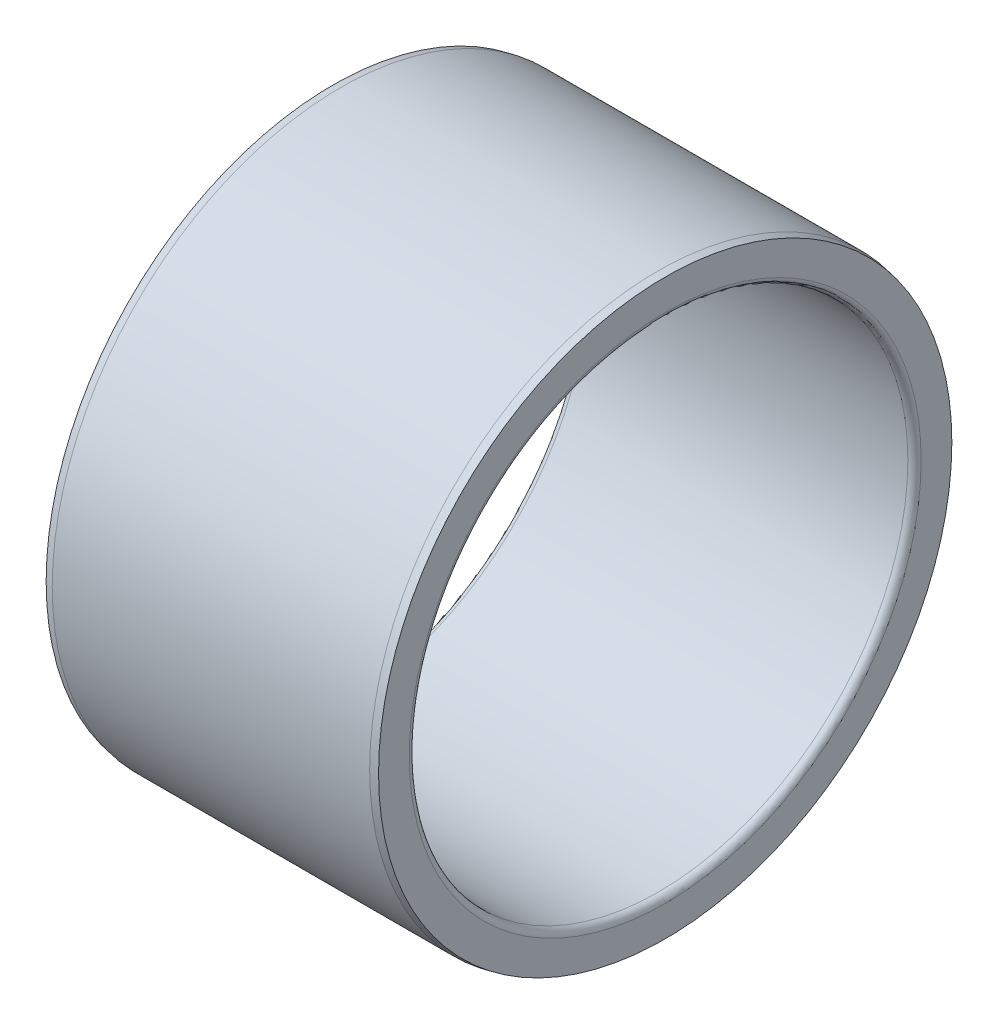
ISO-10303-21;
HEADER;
FILE_DESCRIPTION(('STEP AP214'),'2;1');
FILE_NAME('part.step','',(''),(''),'','','');
FILE_SCHEMA(('AUTOMOTIVE_DESIGN { 1 0 10303 214 1 1 1 1 }'));
ENDSEC;
DATA;
#1=APPLICATION_CONTEXT('core data for automotive mechanical design processes');
#2=APPLICATION_PROTOCOL_DEFINITION('international standard','automotive_design',2000,#1);
#3=PRODUCT_CONTEXT('',#1,'mechanical');
#4=PRODUCT('Part','Part','',(#3));
#5=PRODUCT_RELATED_PRODUCT_CATEGORY('part','',(#4));
#6=PRODUCT_DEFINITION_FORMATION('','',#4);
#7=PRODUCT_DEFINITION_CONTEXT('part definition',#1,'design');
#8=PRODUCT_DEFINITION('design','',#6,#7);
#9=PRODUCT_DEFINITION_SHAPE('','',#8);
#10=(LENGTH_UNIT() NAMED_UNIT(*) SI_UNIT(.MILLI.,.METRE.));
#11=(NAMED_UNIT(*) PLANE_ANGLE_UNIT() SI_UNIT($,.RADIAN.));
#12=(NAMED_UNIT(*) SI_UNIT($,.STERADIAN.) SOLID_ANGLE_UNIT());
#13=UNCERTAINTY_MEASURE_WITH_UNIT(LENGTH_MEASURE(1.E-05),#10,'distance_accuracy_value','');
#14=(GEOMETRIC_REPRESENTATION_CONTEXT(3) GLOBAL_UNCERTAINTY_ASSIGNED_CONTEXT((#13)) GLOBAL_UNIT_ASSIGNED_CONTEXT((#10,
#11,#12)) REPRESENTATION_CONTEXT('',''));
#15=CARTESIAN_POINT('',(0.,0.,0.));
#16=DIRECTION('',(0.,0.,1.));
#17=DIRECTION('',(1.,0.,0.));
#18=AXIS2_PLACEMENT_3D('',#15,#16,#17);
#19=CARTESIAN_POINT('',(0.,25.87063,0.));
#20=DIRECTION('',(-1.,0.,0.));
#21=DIRECTION('',(0.,0.,1.));
#22=AXIS2_PLACEMENT_3D('',#19,#20,#21);
#23=PLANE('',#22);
#24=CARTESIAN_POINT('',(0.,0.,0.));
#25=DIRECTION('',(1.,0.,0.));
#26=DIRECTION('',(0.,0.,-1.));
#27=AXIS2_PLACEMENT_3D('',#24,#25,#26);
#28=CIRCLE('',#27,23.1);
#29=CARTESIAN_POINT('',(0.,0.,-23.1));
#30=VERTEX_POINT('',#29);
#31=EDGE_CURVE('E44',#30,#30,#28,.T.);
#32=ORIENTED_EDGE('',*,*,#31,.T.);
#33=EDGE_LOOP('',(#32));
#34=FACE_BOUND('',#33,.T.);
#35=CARTESIAN_POINT('',(0.,0.,0.));
#36=DIRECTION('',(1.,0.,0.));
#37=DIRECTION('',(0.,0.,-1.));
#38=AXIS2_PLACEMENT_3D('',#35,#36,#37);
#39=CIRCLE('',#38,25.87063);
#40=CARTESIAN_POINT('',(0.,0.,-25.87063));
#41=VERTEX_POINT('',#40);
#42=EDGE_CURVE('E41',#41,#41,#39,.T.);
#43=ORIENTED_EDGE('',*,*,#42,.F.);
#44=EDGE_LOOP('',(#43));
#45=FACE_BOUND('',#44,.T.);
#46=ADVANCED_FACE('F15',(#34,#45),#23,.T.);
#47=CARTESIAN_POINT('',(0.599999999999879,0.,0.));
#48=DIRECTION('',(1.,0.,0.));
#49=DIRECTION('',(0.,0.,-1.));
#50=AXIS2_PLACEMENT_3D('',#47,#48,#49);
#51=TOROIDAL_SURFACE('',#50,23.1,0.599999999999879);
#52=CARTESIAN_POINT('',(0.6,0.,0.));
#53=DIRECTION('',(1.,0.,0.));
#54=DIRECTION('',(0.,0.,-1.));
#55=AXIS2_PLACEMENT_3D('',#52,#53,#54);
#56=CIRCLE('',#55,22.5);
#57=CARTESIAN_POINT('',(0.6,0.,-22.5));
#58=VERTEX_POINT('',#57);
#59=EDGE_CURVE('E38',#58,#58,#56,.T.);
#60=ORIENTED_EDGE('',*,*,#59,.T.);
#61=EDGE_LOOP('',(#60));
#62=FACE_BOUND('',#61,.T.);
#63=ORIENTED_EDGE('',*,*,#31,.F.);
#64=EDGE_LOOP('',(#63));
#65=FACE_BOUND('',#64,.T.);
#66=ADVANCED_FACE('F50',(#62,#65),#51,.T.);
#67=CARTESIAN_POINT('',(0.675,0.,0.));
#68=DIRECTION('',(1.,0.,0.));
#69=DIRECTION('',(0.,0.,-1.));
#70=AXIS2_PLACEMENT_3D('',#67,#68,#69);
#71=CONICAL_SURFACE('',#70,26.,0.189362905035615);
#72=ORIENTED_EDGE('',*,*,#42,.T.);
#73=EDGE_LOOP('',(#72));
#74=FACE_BOUND('',#73,.T.);
#75=CARTESIAN_POINT('',(0.675000000000001,0.,0.));
#76=DIRECTION('',(1.,0.,0.));
#77=DIRECTION('',(0.,0.,-1.));
#78=AXIS2_PLACEMENT_3D('',#75,#76,#77);
#79=CIRCLE('',#78,26.);
#80=CARTESIAN_POINT('',(0.675000000000001,0.,-26.));
#81=VERTEX_POINT('',#80);
#82=EDGE_CURVE('E35',#81,#81,#79,.T.);
#83=ORIENTED_EDGE('',*,*,#82,.F.);
#84=EDGE_LOOP('',(#83));
#85=FACE_BOUND('',#84,.T.);
#86=ADVANCED_FACE('F52',(#74,#85),#71,.T.);
#87=CARTESIAN_POINT('',(30.,0.,0.));
#88=DIRECTION('',(1.,0.,0.));
#89=DIRECTION('',(0.,0.,-1.));
#90=AXIS2_PLACEMENT_3D('',#87,#88,#89);
#91=CYLINDRICAL_SURFACE('',#90,22.5);
#92=CARTESIAN_POINT('',(29.4,0.,0.));
#93=DIRECTION('',(1.,0.,0.));
#94=DIRECTION('',(0.,0.,-1.));
#95=AXIS2_PLACEMENT_3D('',#92,#93,#94);
#96=CIRCLE('',#95,22.5);
#97=CARTESIAN_POINT('',(29.4,0.,-22.5));
#98=VERTEX_POINT('',#97);
#99=EDGE_CURVE('E30',#98,#98,#96,.T.);
#100=ORIENTED_EDGE('',*,*,#99,.T.);
#101=EDGE_LOOP('',(#100));
#102=FACE_BOUND('',#101,.T.);
#103=ORIENTED_EDGE('',*,*,#59,.F.);
#104=EDGE_LOOP('',(#103));
#105=FACE_BOUND('',#104,.T.);
#106=ADVANCED_FACE('F60',(#102,#105),#91,.F.);
#107=CARTESIAN_POINT('',(30.,0.,0.));
#108=DIRECTION('',(1.,0.,0.));
#109=DIRECTION('',(0.,0.,-1.));
#110=AXIS2_PLACEMENT_3D('',#107,#108,#109);
#111=CYLINDRICAL_SURFACE('',#110,26.);
#112=ORIENTED_EDGE('',*,*,#82,.T.);
#113=EDGE_LOOP('',(#112));
#114=FACE_BOUND('',#113,.T.);
#115=CARTESIAN_POINT('',(29.325,0.,0.));
#116=DIRECTION('',(1.,0.,0.));
#117=DIRECTION('',(0.,0.,-1.));
#118=AXIS2_PLACEMENT_3D('',#115,#116,#117);
#119=CIRCLE('',#118,26.);
#120=CARTESIAN_POINT('',(29.325,0.,-26.));
#121=VERTEX_POINT('',#120);
#122=EDGE_CURVE('E26',#121,#121,#119,.T.);
#123=ORIENTED_EDGE('',*,*,#122,.F.);
#124=EDGE_LOOP('',(#123));
#125=FACE_BOUND('',#124,.T.);
#126=ADVANCED_FACE('F67',(#114,#125),#111,.T.);
#127=CARTESIAN_POINT('',(29.4,0.,0.));
#128=DIRECTION('',(1.,0.,0.));
#129=DIRECTION('',(0.,0.,-1.));
#130=AXIS2_PLACEMENT_3D('',#127,#128,#129);
#131=TOROIDAL_SURFACE('',#130,23.0999999999997,0.599999999999754);
#132=CARTESIAN_POINT('',(30.,0.,0.));
#133=DIRECTION('',(1.,0.,0.));
#134=DIRECTION('',(0.,0.,-1.));
#135=AXIS2_PLACEMENT_3D('',#132,#133,#134);
#136=CIRCLE('',#135,23.0999999999997);
#137=CARTESIAN_POINT('',(30.,0.,-23.0999999999997));
#138=VERTEX_POINT('',#137);
#139=EDGE_CURVE('E22',#138,#138,#136,.T.);
#140=ORIENTED_EDGE('',*,*,#139,.T.);
#141=EDGE_LOOP('',(#140));
#142=FACE_BOUND('',#141,.T.);
#143=ORIENTED_EDGE('',*,*,#99,.F.);
#144=EDGE_LOOP('',(#143));
#145=FACE_BOUND('',#144,.T.);
#146=ADVANCED_FACE('F71',(#142,#145),#131,.T.);
#147=CARTESIAN_POINT('',(30.,0.,0.));
#148=DIRECTION('',(-1.,0.,0.));
#149=DIRECTION('',(0.,0.,1.));
#150=AXIS2_PLACEMENT_3D('',#147,#148,#149);
#151=CONICAL_SURFACE('',#150,25.87063,0.189362905035615);
#152=ORIENTED_EDGE('',*,*,#122,.T.);
#153=EDGE_LOOP('',(#152));
#154=FACE_BOUND('',#153,.T.);
#155=CARTESIAN_POINT('',(30.,0.,0.));
#156=DIRECTION('',(1.,0.,0.));
#157=DIRECTION('',(0.,0.,-1.));
#158=AXIS2_PLACEMENT_3D('',#155,#156,#157);
#159=CIRCLE('',#158,25.87063);
#160=CARTESIAN_POINT('',(30.,0.,-25.87063));
#161=VERTEX_POINT('',#160);
#162=EDGE_CURVE('E10',#161,#161,#159,.T.);
#163=ORIENTED_EDGE('',*,*,#162,.F.);
#164=EDGE_LOOP('',(#163));
#165=FACE_BOUND('',#164,.T.);
#166=ADVANCED_FACE('F74',(#154,#165),#151,.T.);
#167=CARTESIAN_POINT('',(30.,23.1,0.));
#168=DIRECTION('',(1.,0.,0.));
#169=DIRECTION('',(0.,0.,-1.));
#170=AXIS2_PLACEMENT_3D('',#167,#168,#169);
#171=PLANE('',#170);
#172=ORIENTED_EDGE('',*,*,#162,.T.);
#173=EDGE_LOOP('',(#172));
#174=FACE_BOUND('',#173,.T.);
#175=ORIENTED_EDGE('',*,*,#139,.F.);
#176=EDGE_LOOP('',(#175));
#177=FACE_BOUND('',#176,.T.);
#178=ADVANCED_FACE('F17',(#174,#177),#171,.T.);
#179=CLOSED_SHELL('',(#46,#66,#86,#106,#126,#146,#166,#178));
#180=MANIFOLD_SOLID_BREP('B1',#179);
#181=ADVANCED_BREP_SHAPE_REPRESENTATION('',(#18,#180),#14);
#182=SHAPE_DEFINITION_REPRESENTATION(#9,#181);
ENDSEC;
END-ISO-10303-21;
